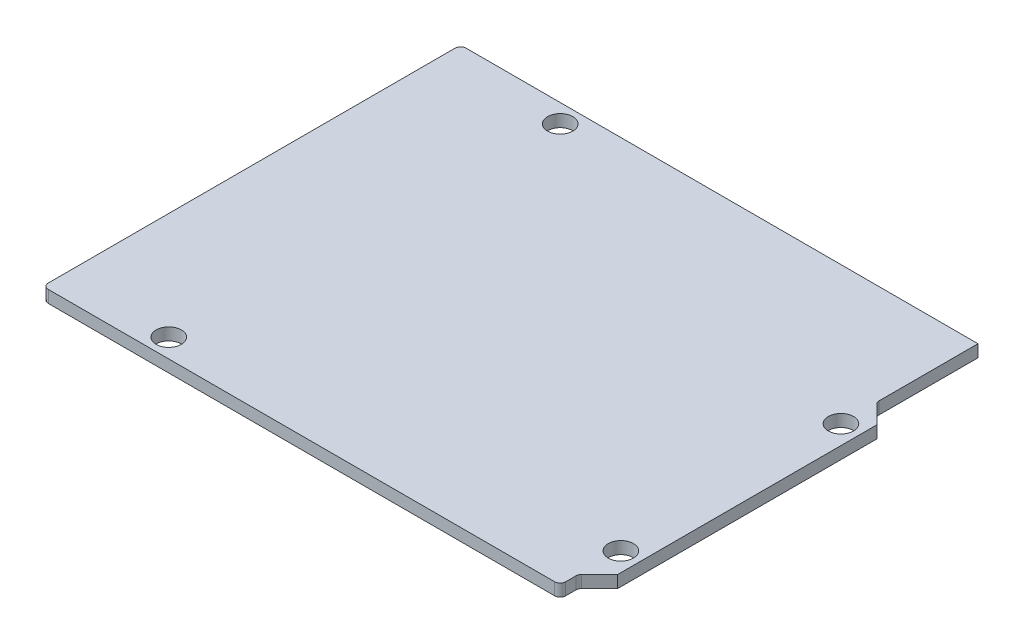
ISO-10303-21;
HEADER;
FILE_DESCRIPTION(('STEP AP214'),'2;1');
FILE_NAME('part.step','',(''),(''),'','','');
FILE_SCHEMA(('AUTOMOTIVE_DESIGN { 1 0 10303 214 1 1 1 1 }'));
ENDSEC;
DATA;
#1=APPLICATION_CONTEXT('core data for automotive mechanical design processes');
#2=APPLICATION_PROTOCOL_DEFINITION('international standard','automotive_design',2000,#1);
#3=PRODUCT_CONTEXT('',#1,'mechanical');
#4=PRODUCT('Part','Part','',(#3));
#5=PRODUCT_RELATED_PRODUCT_CATEGORY('part','',(#4));
#6=PRODUCT_DEFINITION_FORMATION('','',#4);
#7=PRODUCT_DEFINITION_CONTEXT('part definition',#1,'design');
#8=PRODUCT_DEFINITION('design','',#6,#7);
#9=PRODUCT_DEFINITION_SHAPE('','',#8);
#10=(LENGTH_UNIT() NAMED_UNIT(*) SI_UNIT(.MILLI.,.METRE.));
#11=(NAMED_UNIT(*) PLANE_ANGLE_UNIT() SI_UNIT($,.RADIAN.));
#12=(NAMED_UNIT(*) SI_UNIT($,.STERADIAN.) SOLID_ANGLE_UNIT());
#13=UNCERTAINTY_MEASURE_WITH_UNIT(LENGTH_MEASURE(1.E-05),#10,'distance_accuracy_value','');
#14=(GEOMETRIC_REPRESENTATION_CONTEXT(3) GLOBAL_UNCERTAINTY_ASSIGNED_CONTEXT((#13)) GLOBAL_UNIT_ASSIGNED_CONTEXT((#10,
#11,#12)) REPRESENTATION_CONTEXT('',''));
#15=CARTESIAN_POINT('',(0.,0.,0.));
#16=DIRECTION('',(0.,0.,1.));
#17=DIRECTION('',(1.,0.,0.));
#18=AXIS2_PLACEMENT_3D('',#15,#16,#17);
#19=CARTESIAN_POINT('',(0.,1.55,0.));
#20=DIRECTION('',(0.,-1.,0.));
#21=DIRECTION('',(0.,0.,-1.));
#22=AXIS2_PLACEMENT_3D('',#19,#20,#21);
#23=PLANE('',#22);
#24=CARTESIAN_POINT('',(65.8,1.55,-7.6));
#25=DIRECTION('',(0.,1.,0.));
#26=DIRECTION('',(0.,0.,1.));
#27=AXIS2_PLACEMENT_3D('',#24,#25,#26);
#28=CIRCLE('',#27,1.60000000000001);
#29=CARTESIAN_POINT('',(65.8,1.55,-5.99999999999999));
#30=VERTEX_POINT('',#29);
#31=EDGE_CURVE('E370',#30,#30,#28,.T.);
#32=ORIENTED_EDGE('',*,*,#31,.F.);
#33=EDGE_LOOP('',(#32));
#34=FACE_BOUND('',#33,.T.);
#35=CARTESIAN_POINT('',(15.,1.55,-50.7));
#36=DIRECTION('',(0.,1.,0.));
#37=DIRECTION('',(0.,0.,1.));
#38=AXIS2_PLACEMENT_3D('',#35,#36,#37);
#39=CIRCLE('',#38,1.6);
#40=CARTESIAN_POINT('',(15.,1.55,-49.1));
#41=VERTEX_POINT('',#40);
#42=EDGE_CURVE('E186',#41,#41,#39,.T.);
#43=ORIENTED_EDGE('',*,*,#42,.F.);
#44=EDGE_LOOP('',(#43));
#45=FACE_BOUND('',#44,.T.);
#46=DIRECTION('',(1.,0.,0.));
#47=VECTOR('',#46,1.);
#48=CARTESIAN_POINT('',(0.,1.55,0.));
#49=LINE('',#48,#47);
#50=CARTESIAN_POINT('',(0.7,1.55,0.));
#51=VERTEX_POINT('',#50);
#52=CARTESIAN_POINT('',(65.,1.55,0.));
#53=VERTEX_POINT('',#52);
#54=EDGE_CURVE('E336',#51,#53,#49,.T.);
#55=ORIENTED_EDGE('',*,*,#54,.T.);
#56=CARTESIAN_POINT('',(65.,1.55,-0.7));
#57=DIRECTION('',(0.,-1.,0.));
#58=DIRECTION('',(0.,0.,-1.));
#59=AXIS2_PLACEMENT_3D('',#56,#57,#58);
#60=CIRCLE('',#59,0.7);
#61=CARTESIAN_POINT('',(65.7,1.55,-0.7));
#62=VERTEX_POINT('',#61);
#63=EDGE_CURVE('E252',#53,#62,#60,.F.);
#64=ORIENTED_EDGE('',*,*,#63,.T.);
#65=DIRECTION('',(0.,0.,-1.));
#66=VECTOR('',#65,1.);
#67=CARTESIAN_POINT('',(65.7,1.55,-2.3));
#68=LINE('',#67,#66);
#69=CARTESIAN_POINT('',(65.7,1.55,-2.01005050633884));
#70=VERTEX_POINT('',#69);
#71=EDGE_CURVE('E150',#62,#70,#68,.T.);
#72=ORIENTED_EDGE('',*,*,#71,.T.);
#73=CARTESIAN_POINT('',(66.4,1.55,-2.01005050633884));
#74=DIRECTION('',(0.,-1.,0.));
#75=DIRECTION('',(0.,0.,-1.));
#76=AXIS2_PLACEMENT_3D('',#73,#74,#75);
#77=CIRCLE('',#76,0.7);
#78=CARTESIAN_POINT('',(65.9050252531694,1.55,-2.50502525316943));
#79=VERTEX_POINT('',#78);
#80=EDGE_CURVE('E11',#70,#79,#77,.T.);
#81=ORIENTED_EDGE('',*,*,#80,.T.);
#82=DIRECTION('',(0.707106781186549,0.,-0.707106781186546));
#83=VECTOR('',#82,1.);
#84=CARTESIAN_POINT('',(68.2,1.55,-4.79999999999999));
#85=LINE('',#84,#83);
#86=CARTESIAN_POINT('',(68.2,1.55,-4.79999999999999));
#87=VERTEX_POINT('',#86);
#88=EDGE_CURVE('E136',#79,#87,#85,.T.);
#89=ORIENTED_EDGE('',*,*,#88,.T.);
#90=DIRECTION('',(0.,0.,-1.));
#91=VECTOR('',#90,1.);
#92=CARTESIAN_POINT('',(68.2,1.55,-4.79999999999999));
#93=LINE('',#92,#91);
#94=CARTESIAN_POINT('',(68.2,1.55,-37.7));
#95=VERTEX_POINT('',#94);
#96=EDGE_CURVE('E142',#87,#95,#93,.T.);
#97=ORIENTED_EDGE('',*,*,#96,.T.);
#98=DIRECTION('',(-0.707106781186548,0.,-0.707106781186546));
#99=VECTOR('',#98,1.);
#100=CARTESIAN_POINT('',(65.7,1.55,-40.2));
#101=LINE('',#100,#99);
#102=CARTESIAN_POINT('',(65.9050252531694,1.55,-39.9949747468306));
#103=VERTEX_POINT('',#102);
#104=EDGE_CURVE('E167',#95,#103,#101,.T.);
#105=ORIENTED_EDGE('',*,*,#104,.T.);
#106=CARTESIAN_POINT('',(66.4,1.55,-40.4899494936611));
#107=DIRECTION('',(0.,-1.,0.));
#108=DIRECTION('',(0.,0.,-1.));
#109=AXIS2_PLACEMENT_3D('',#106,#107,#108);
#110=CIRCLE('',#109,0.7);
#111=CARTESIAN_POINT('',(65.7,1.55,-40.4899494936612));
#112=VERTEX_POINT('',#111);
#113=EDGE_CURVE('E265',#103,#112,#110,.T.);
#114=ORIENTED_EDGE('',*,*,#113,.T.);
#115=DIRECTION('',(0.,0.,-1.));
#116=VECTOR('',#115,1.);
#117=CARTESIAN_POINT('',(65.7,1.55,-53.05));
#118=LINE('',#117,#116);
#119=CARTESIAN_POINT('',(65.7,1.55,-53.05));
#120=VERTEX_POINT('',#119);
#121=EDGE_CURVE('E172',#112,#120,#118,.T.);
#122=ORIENTED_EDGE('',*,*,#121,.T.);
#123=DIRECTION('',(-1.,0.,0.));
#124=VECTOR('',#123,1.);
#125=CARTESIAN_POINT('',(0.,1.55,-53.05));
#126=LINE('',#125,#124);
#127=CARTESIAN_POINT('',(0.7,1.55,-53.05));
#128=VERTEX_POINT('',#127);
#129=EDGE_CURVE('E178',#120,#128,#126,.T.);
#130=ORIENTED_EDGE('',*,*,#129,.T.);
#131=CARTESIAN_POINT('',(0.7,1.55,-52.35));
#132=DIRECTION('',(0.,-1.,0.));
#133=DIRECTION('',(0.,0.,-1.));
#134=AXIS2_PLACEMENT_3D('',#131,#132,#133);
#135=CIRCLE('',#134,0.7);
#136=CARTESIAN_POINT('',(0.,1.55,-52.35));
#137=VERTEX_POINT('',#136);
#138=EDGE_CURVE('E249',#128,#137,#135,.F.);
#139=ORIENTED_EDGE('',*,*,#138,.T.);
#140=DIRECTION('',(0.,0.,1.));
#141=VECTOR('',#140,1.);
#142=CARTESIAN_POINT('',(0.,1.55,0.));
#143=LINE('',#142,#141);
#144=CARTESIAN_POINT('',(0.,1.55,-0.7));
#145=VERTEX_POINT('',#144);
#146=EDGE_CURVE('E208',#137,#145,#143,.T.);
#147=ORIENTED_EDGE('',*,*,#146,.T.);
#148=CARTESIAN_POINT('',(0.7,1.55,-0.7));
#149=DIRECTION('',(0.,-1.,0.));
#150=DIRECTION('',(0.,0.,-1.));
#151=AXIS2_PLACEMENT_3D('',#148,#149,#150);
#152=CIRCLE('',#151,0.7);
#153=EDGE_CURVE('E246',#145,#51,#152,.F.);
#154=ORIENTED_EDGE('',*,*,#153,.T.);
#155=EDGE_LOOP('',(#55,#64,#72,#81,#89,#97,#105,#114,#122,#130,#139,#147,#154));
#156=FACE_BOUND('',#155,.T.);
#157=CARTESIAN_POINT('',(13.6,1.55,-2.4));
#158=DIRECTION('',(0.,1.,0.));
#159=DIRECTION('',(0.,0.,1.));
#160=AXIS2_PLACEMENT_3D('',#157,#158,#159);
#161=CIRCLE('',#160,1.6);
#162=CARTESIAN_POINT('',(13.6,1.55,-0.799999999999998));
#163=VERTEX_POINT('',#162);
#164=EDGE_CURVE('E362',#163,#163,#161,.T.);
#165=ORIENTED_EDGE('',*,*,#164,.F.);
#166=EDGE_LOOP('',(#165));
#167=FACE_BOUND('',#166,.T.);
#168=CARTESIAN_POINT('',(65.8,1.55,-35.55));
#169=DIRECTION('',(0.,1.,0.));
#170=DIRECTION('',(0.,0.,1.));
#171=AXIS2_PLACEMENT_3D('',#168,#169,#170);
#172=CIRCLE('',#171,1.60000000000001);
#173=CARTESIAN_POINT('',(65.8,1.55,-33.95));
#174=VERTEX_POINT('',#173);
#175=EDGE_CURVE('E378',#174,#174,#172,.T.);
#176=ORIENTED_EDGE('',*,*,#175,.F.);
#177=EDGE_LOOP('',(#176));
#178=FACE_BOUND('',#177,.T.);
#179=ADVANCED_FACE('F38',(#34,#45,#156,#167,#178),#23,.F.);
#180=CARTESIAN_POINT('',(0.,0.,0.));
#181=DIRECTION('',(0.,-1.,0.));
#182=DIRECTION('',(0.,0.,-1.));
#183=AXIS2_PLACEMENT_3D('',#180,#181,#182);
#184=PLANE('',#183);
#185=CARTESIAN_POINT('',(65.8,0.,-7.6));
#186=DIRECTION('',(0.,1.,0.));
#187=DIRECTION('',(0.,0.,1.));
#188=AXIS2_PLACEMENT_3D('',#185,#186,#187);
#189=CIRCLE('',#188,1.60000000000001);
#190=CARTESIAN_POINT('',(65.8,0.,-5.99999999999999));
#191=VERTEX_POINT('',#190);
#192=EDGE_CURVE('E374',#191,#191,#189,.T.);
#193=ORIENTED_EDGE('',*,*,#192,.T.);
#194=EDGE_LOOP('',(#193));
#195=FACE_BOUND('',#194,.T.);
#196=CARTESIAN_POINT('',(15.,0.,-50.7));
#197=DIRECTION('',(0.,1.,0.));
#198=DIRECTION('',(0.,0.,1.));
#199=AXIS2_PLACEMENT_3D('',#196,#197,#198);
#200=CIRCLE('',#199,1.6);
#201=CARTESIAN_POINT('',(15.,0.,-49.1));
#202=VERTEX_POINT('',#201);
#203=EDGE_CURVE('E358',#202,#202,#200,.T.);
#204=ORIENTED_EDGE('',*,*,#203,.T.);
#205=EDGE_LOOP('',(#204));
#206=FACE_BOUND('',#205,.T.);
#207=DIRECTION('',(0.,0.,-1.));
#208=VECTOR('',#207,1.);
#209=CARTESIAN_POINT('',(65.7,0.,-2.3));
#210=LINE('',#209,#208);
#211=CARTESIAN_POINT('',(65.7,0.,-0.7));
#212=VERTEX_POINT('',#211);
#213=CARTESIAN_POINT('',(65.7,0.,-2.01005050633884));
#214=VERTEX_POINT('',#213);
#215=EDGE_CURVE('E190',#212,#214,#210,.T.);
#216=ORIENTED_EDGE('',*,*,#215,.F.);
#217=CARTESIAN_POINT('',(65.,0.,-0.7));
#218=DIRECTION('',(0.,-1.,0.));
#219=DIRECTION('',(0.,0.,-1.));
#220=AXIS2_PLACEMENT_3D('',#217,#218,#219);
#221=CIRCLE('',#220,0.7);
#222=CARTESIAN_POINT('',(65.,0.,0.));
#223=VERTEX_POINT('',#222);
#224=EDGE_CURVE('E236',#212,#223,#221,.T.);
#225=ORIENTED_EDGE('',*,*,#224,.T.);
#226=DIRECTION('',(1.,0.,0.));
#227=VECTOR('',#226,1.);
#228=CARTESIAN_POINT('',(0.,0.,0.));
#229=LINE('',#228,#227);
#230=CARTESIAN_POINT('',(0.7,0.,0.));
#231=VERTEX_POINT('',#230);
#232=EDGE_CURVE('E185',#231,#223,#229,.T.);
#233=ORIENTED_EDGE('',*,*,#232,.F.);
#234=CARTESIAN_POINT('',(0.7,0.,-0.7));
#235=DIRECTION('',(0.,-1.,0.));
#236=DIRECTION('',(0.,0.,-1.));
#237=AXIS2_PLACEMENT_3D('',#234,#235,#236);
#238=CIRCLE('',#237,0.7);
#239=CARTESIAN_POINT('',(0.,0.,-0.7));
#240=VERTEX_POINT('',#239);
#241=EDGE_CURVE('E230',#231,#240,#238,.T.);
#242=ORIENTED_EDGE('',*,*,#241,.T.);
#243=DIRECTION('',(0.,0.,1.));
#244=VECTOR('',#243,1.);
#245=CARTESIAN_POINT('',(0.,0.,0.));
#246=LINE('',#245,#244);
#247=CARTESIAN_POINT('',(0.,0.,-52.35));
#248=VERTEX_POINT('',#247);
#249=EDGE_CURVE('E182',#248,#240,#246,.T.);
#250=ORIENTED_EDGE('',*,*,#249,.F.);
#251=CARTESIAN_POINT('',(0.7,0.,-52.35));
#252=DIRECTION('',(0.,-1.,0.));
#253=DIRECTION('',(0.,0.,-1.));
#254=AXIS2_PLACEMENT_3D('',#251,#252,#253);
#255=CIRCLE('',#254,0.7);
#256=CARTESIAN_POINT('',(0.7,0.,-53.05));
#257=VERTEX_POINT('',#256);
#258=EDGE_CURVE('E233',#248,#257,#255,.T.);
#259=ORIENTED_EDGE('',*,*,#258,.T.);
#260=DIRECTION('',(-1.,0.,0.));
#261=VECTOR('',#260,1.);
#262=CARTESIAN_POINT('',(0.,0.,-53.05));
#263=LINE('',#262,#261);
#264=CARTESIAN_POINT('',(65.7,0.,-53.05));
#265=VERTEX_POINT('',#264);
#266=EDGE_CURVE('E205',#265,#257,#263,.T.);
#267=ORIENTED_EDGE('',*,*,#266,.F.);
#268=DIRECTION('',(0.,0.,-1.));
#269=VECTOR('',#268,1.);
#270=CARTESIAN_POINT('',(65.7,0.,-53.05));
#271=LINE('',#270,#269);
#272=CARTESIAN_POINT('',(65.7,0.,-40.4899494936612));
#273=VERTEX_POINT('',#272);
#274=EDGE_CURVE('E202',#273,#265,#271,.T.);
#275=ORIENTED_EDGE('',*,*,#274,.F.);
#276=CARTESIAN_POINT('',(66.4,0.,-40.4899494936611));
#277=DIRECTION('',(0.,-1.,0.));
#278=DIRECTION('',(0.,0.,-1.));
#279=AXIS2_PLACEMENT_3D('',#276,#277,#278);
#280=CIRCLE('',#279,0.7);
#281=CARTESIAN_POINT('',(65.9050252531694,0.,-39.9949747468306));
#282=VERTEX_POINT('',#281);
#283=EDGE_CURVE('E263',#273,#282,#280,.F.);
#284=ORIENTED_EDGE('',*,*,#283,.T.);
#285=DIRECTION('',(-0.707106781186548,0.,-0.707106781186546));
#286=VECTOR('',#285,1.);
#287=CARTESIAN_POINT('',(65.7,0.,-40.2));
#288=LINE('',#287,#286);
#289=CARTESIAN_POINT('',(68.2,0.,-37.7));
#290=VERTEX_POINT('',#289);
#291=EDGE_CURVE('E198',#290,#282,#288,.T.);
#292=ORIENTED_EDGE('',*,*,#291,.F.);
#293=DIRECTION('',(0.,0.,-1.));
#294=VECTOR('',#293,1.);
#295=CARTESIAN_POINT('',(68.2,0.,-4.79999999999999));
#296=LINE('',#295,#294);
#297=CARTESIAN_POINT('',(68.2,0.,-4.79999999999999));
#298=VERTEX_POINT('',#297);
#299=EDGE_CURVE('E196',#298,#290,#296,.T.);
#300=ORIENTED_EDGE('',*,*,#299,.F.);
#301=DIRECTION('',(0.707106781186549,0.,-0.707106781186546));
#302=VECTOR('',#301,1.);
#303=CARTESIAN_POINT('',(68.2,0.,-4.79999999999999));
#304=LINE('',#303,#302);
#305=CARTESIAN_POINT('',(65.9050252531694,0.,-2.50502525316943));
#306=VERTEX_POINT('',#305);
#307=EDGE_CURVE('E156',#306,#298,#304,.T.);
#308=ORIENTED_EDGE('',*,*,#307,.F.);
#309=CARTESIAN_POINT('',(66.4,0.,-2.01005050633884));
#310=DIRECTION('',(0.,-1.,0.));
#311=DIRECTION('',(0.,0.,-1.));
#312=AXIS2_PLACEMENT_3D('',#309,#310,#311);
#313=CIRCLE('',#312,0.7);
#314=EDGE_CURVE('E47',#306,#214,#313,.F.);
#315=ORIENTED_EDGE('',*,*,#314,.T.);
#316=EDGE_LOOP('',(#216,#225,#233,#242,#250,#259,#267,#275,#284,#292,#300,#308,#315));
#317=FACE_BOUND('',#316,.T.);
#318=CARTESIAN_POINT('',(13.6,0.,-2.4));
#319=DIRECTION('',(0.,1.,0.));
#320=DIRECTION('',(0.,0.,1.));
#321=AXIS2_PLACEMENT_3D('',#318,#319,#320);
#322=CIRCLE('',#321,1.6);
#323=CARTESIAN_POINT('',(13.6,0.,-0.799999999999998));
#324=VERTEX_POINT('',#323);
#325=EDGE_CURVE('E366',#324,#324,#322,.T.);
#326=ORIENTED_EDGE('',*,*,#325,.T.);
#327=EDGE_LOOP('',(#326));
#328=FACE_BOUND('',#327,.T.);
#329=CARTESIAN_POINT('',(65.8,0.,-35.55));
#330=DIRECTION('',(0.,1.,0.));
#331=DIRECTION('',(0.,0.,1.));
#332=AXIS2_PLACEMENT_3D('',#329,#330,#331);
#333=CIRCLE('',#332,1.60000000000001);
#334=CARTESIAN_POINT('',(65.8,0.,-33.95));
#335=VERTEX_POINT('',#334);
#336=EDGE_CURVE('E382',#335,#335,#333,.T.);
#337=ORIENTED_EDGE('',*,*,#336,.T.);
#338=EDGE_LOOP('',(#337));
#339=FACE_BOUND('',#338,.T.);
#340=ADVANCED_FACE('F270',(#195,#206,#317,#328,#339),#184,.T.);
#341=CARTESIAN_POINT('',(0.,1.55,0.));
#342=DIRECTION('',(1.,0.,0.));
#343=DIRECTION('',(0.,0.,-1.));
#344=AXIS2_PLACEMENT_3D('',#341,#342,#343);
#345=PLANE('',#344);
#346=ORIENTED_EDGE('',*,*,#146,.F.);
#347=DIRECTION('',(0.,-1.,0.));
#348=VECTOR('',#347,1.);
#349=CARTESIAN_POINT('',(0.,1.55,-52.35));
#350=LINE('',#349,#348);
#351=EDGE_CURVE('E257',#137,#248,#350,.T.);
#352=ORIENTED_EDGE('',*,*,#351,.T.);
#353=ORIENTED_EDGE('',*,*,#249,.T.);
#354=DIRECTION('',(0.,-1.,0.));
#355=VECTOR('',#354,1.);
#356=CARTESIAN_POINT('',(0.,1.55,-0.7));
#357=LINE('',#356,#355);
#358=EDGE_CURVE('E62',#240,#145,#357,.F.);
#359=ORIENTED_EDGE('',*,*,#358,.T.);
#360=EDGE_LOOP('',(#346,#352,#353,#359));
#361=FACE_BOUND('',#360,.T.);
#362=ADVANCED_FACE('F299',(#361),#345,.F.);
#363=CARTESIAN_POINT('',(0.,1.55,0.));
#364=DIRECTION('',(0.,0.,-1.));
#365=DIRECTION('',(-1.,0.,0.));
#366=AXIS2_PLACEMENT_3D('',#363,#364,#365);
#367=PLANE('',#366);
#368=ORIENTED_EDGE('',*,*,#232,.T.);
#369=DIRECTION('',(0.,-1.,0.));
#370=VECTOR('',#369,1.);
#371=CARTESIAN_POINT('',(65.,1.55,0.));
#372=LINE('',#371,#370);
#373=EDGE_CURVE('E243',#223,#53,#372,.F.);
#374=ORIENTED_EDGE('',*,*,#373,.T.);
#375=ORIENTED_EDGE('',*,*,#54,.F.);
#376=DIRECTION('',(0.,-1.,0.));
#377=VECTOR('',#376,1.);
#378=CARTESIAN_POINT('',(0.7,1.55,0.));
#379=LINE('',#378,#377);
#380=EDGE_CURVE('E239',#51,#231,#379,.T.);
#381=ORIENTED_EDGE('',*,*,#380,.T.);
#382=EDGE_LOOP('',(#368,#374,#375,#381));
#383=FACE_BOUND('',#382,.T.);
#384=ADVANCED_FACE('F325',(#383),#367,.F.);
#385=CARTESIAN_POINT('',(65.7,1.55,-2.3));
#386=DIRECTION('',(-1.,0.,0.));
#387=DIRECTION('',(0.,0.,1.));
#388=AXIS2_PLACEMENT_3D('',#385,#386,#387);
#389=PLANE('',#388);
#390=ORIENTED_EDGE('',*,*,#215,.T.);
#391=DIRECTION('',(0.,-1.,0.));
#392=VECTOR('',#391,1.);
#393=CARTESIAN_POINT('',(65.7,1.55,-2.01005050633884));
#394=LINE('',#393,#392);
#395=EDGE_CURVE('E227',#214,#70,#394,.F.);
#396=ORIENTED_EDGE('',*,*,#395,.T.);
#397=ORIENTED_EDGE('',*,*,#71,.F.);
#398=DIRECTION('',(0.,-1.,0.));
#399=VECTOR('',#398,1.);
#400=CARTESIAN_POINT('',(65.7,1.55,-0.7));
#401=LINE('',#400,#399);
#402=EDGE_CURVE('E223',#62,#212,#401,.T.);
#403=ORIENTED_EDGE('',*,*,#402,.T.);
#404=EDGE_LOOP('',(#390,#396,#397,#403));
#405=FACE_BOUND('',#404,.T.);
#406=ADVANCED_FACE('F275',(#405),#389,.F.);
#407=CARTESIAN_POINT('',(68.2,1.55,-4.79999999999999));
#408=DIRECTION('',(-0.707106781186546,0.,-0.707106781186549));
#409=DIRECTION('',(-0.707106781186549,0.,0.707106781186546));
#410=AXIS2_PLACEMENT_3D('',#407,#408,#409);
#411=PLANE('',#410);
#412=ORIENTED_EDGE('',*,*,#88,.F.);
#413=DIRECTION('',(0.,-1.,0.));
#414=VECTOR('',#413,1.);
#415=CARTESIAN_POINT('',(65.9050252531694,0.,-2.50502525316943));
#416=LINE('',#415,#414);
#417=EDGE_CURVE('E220',#79,#306,#416,.T.);
#418=ORIENTED_EDGE('',*,*,#417,.T.);
#419=ORIENTED_EDGE('',*,*,#307,.T.);
#420=DIRECTION('',(0.,-1.,0.));
#421=VECTOR('',#420,1.);
#422=CARTESIAN_POINT('',(68.2,1.55,-4.79999999999999));
#423=LINE('',#422,#421);
#424=EDGE_CURVE('E153',#87,#298,#423,.T.);
#425=ORIENTED_EDGE('',*,*,#424,.F.);
#426=EDGE_LOOP('',(#412,#418,#419,#425));
#427=FACE_BOUND('',#426,.T.);
#428=ADVANCED_FACE('F154',(#427),#411,.F.);
#429=CARTESIAN_POINT('',(68.2,1.55,-4.79999999999999));
#430=DIRECTION('',(-1.,0.,0.));
#431=DIRECTION('',(0.,0.,1.));
#432=AXIS2_PLACEMENT_3D('',#429,#430,#431);
#433=PLANE('',#432);
#434=ORIENTED_EDGE('',*,*,#299,.T.);
#435=DIRECTION('',(0.,-1.,0.));
#436=VECTOR('',#435,1.);
#437=CARTESIAN_POINT('',(68.2,1.55,-37.7));
#438=LINE('',#437,#436);
#439=EDGE_CURVE('E161',#95,#290,#438,.T.);
#440=ORIENTED_EDGE('',*,*,#439,.F.);
#441=ORIENTED_EDGE('',*,*,#96,.F.);
#442=ORIENTED_EDGE('',*,*,#424,.T.);
#443=EDGE_LOOP('',(#434,#440,#441,#442));
#444=FACE_BOUND('',#443,.T.);
#445=ADVANCED_FACE('F163',(#444),#433,.F.);
#446=CARTESIAN_POINT('',(65.7,1.55,-40.2));
#447=DIRECTION('',(-0.707106781186546,0.,0.707106781186549));
#448=DIRECTION('',(0.707106781186549,0.,0.707106781186546));
#449=AXIS2_PLACEMENT_3D('',#446,#447,#448);
#450=PLANE('',#449);
#451=ORIENTED_EDGE('',*,*,#291,.T.);
#452=DIRECTION('',(0.,-1.,0.));
#453=VECTOR('',#452,1.);
#454=CARTESIAN_POINT('',(65.9050252531694,1.55,-39.9949747468306));
#455=LINE('',#454,#453);
#456=EDGE_CURVE('E217',#282,#103,#455,.F.);
#457=ORIENTED_EDGE('',*,*,#456,.T.);
#458=ORIENTED_EDGE('',*,*,#104,.F.);
#459=ORIENTED_EDGE('',*,*,#439,.T.);
#460=EDGE_LOOP('',(#451,#457,#458,#459));
#461=FACE_BOUND('',#460,.T.);
#462=ADVANCED_FACE('F314',(#461),#450,.F.);
#463=CARTESIAN_POINT('',(65.7,1.55,-53.05));
#464=DIRECTION('',(-1.,0.,0.));
#465=DIRECTION('',(0.,0.,1.));
#466=AXIS2_PLACEMENT_3D('',#463,#464,#465);
#467=PLANE('',#466);
#468=ORIENTED_EDGE('',*,*,#121,.F.);
#469=DIRECTION('',(0.,-1.,0.));
#470=VECTOR('',#469,1.);
#471=CARTESIAN_POINT('',(65.7,0.,-40.4899494936611));
#472=LINE('',#471,#470);
#473=EDGE_CURVE('E160',#112,#273,#472,.T.);
#474=ORIENTED_EDGE('',*,*,#473,.T.);
#475=ORIENTED_EDGE('',*,*,#274,.T.);
#476=DIRECTION('',(0.,-1.,0.));
#477=VECTOR('',#476,1.);
#478=CARTESIAN_POINT('',(65.7,1.55,-53.05));
#479=LINE('',#478,#477);
#480=EDGE_CURVE('E181',#120,#265,#479,.T.);
#481=ORIENTED_EDGE('',*,*,#480,.F.);
#482=EDGE_LOOP('',(#468,#474,#475,#481));
#483=FACE_BOUND('',#482,.T.);
#484=ADVANCED_FACE('F311',(#483),#467,.F.);
#485=CARTESIAN_POINT('',(0.,1.55,-53.05));
#486=DIRECTION('',(0.,0.,1.));
#487=DIRECTION('',(1.,0.,0.));
#488=AXIS2_PLACEMENT_3D('',#485,#486,#487);
#489=PLANE('',#488);
#490=ORIENTED_EDGE('',*,*,#266,.T.);
#491=DIRECTION('',(0.,-1.,0.));
#492=VECTOR('',#491,1.);
#493=CARTESIAN_POINT('',(0.7,1.55,-53.05));
#494=LINE('',#493,#492);
#495=EDGE_CURVE('E54',#257,#128,#494,.F.);
#496=ORIENTED_EDGE('',*,*,#495,.T.);
#497=ORIENTED_EDGE('',*,*,#129,.F.);
#498=ORIENTED_EDGE('',*,*,#480,.T.);
#499=EDGE_LOOP('',(#490,#496,#497,#498));
#500=FACE_BOUND('',#499,.T.);
#501=ADVANCED_FACE('F308',(#500),#489,.F.);
#502=CARTESIAN_POINT('',(15.,1.55,-50.7));
#503=DIRECTION('',(0.,-1.,0.));
#504=DIRECTION('',(0.,0.,-1.));
#505=AXIS2_PLACEMENT_3D('',#502,#503,#504);
#506=CYLINDRICAL_SURFACE('',#505,1.6);
#507=ORIENTED_EDGE('',*,*,#42,.T.);
#508=EDGE_LOOP('',(#507));
#509=FACE_BOUND('',#508,.T.);
#510=ORIENTED_EDGE('',*,*,#203,.F.);
#511=EDGE_LOOP('',(#510));
#512=FACE_BOUND('',#511,.T.);
#513=ADVANCED_FACE('F305',(#509,#512),#506,.F.);
#514=CARTESIAN_POINT('',(13.6,1.55,-2.4));
#515=DIRECTION('',(0.,-1.,0.));
#516=DIRECTION('',(0.,0.,-1.));
#517=AXIS2_PLACEMENT_3D('',#514,#515,#516);
#518=CYLINDRICAL_SURFACE('',#517,1.6);
#519=ORIENTED_EDGE('',*,*,#164,.T.);
#520=EDGE_LOOP('',(#519));
#521=FACE_BOUND('',#520,.T.);
#522=ORIENTED_EDGE('',*,*,#325,.F.);
#523=EDGE_LOOP('',(#522));
#524=FACE_BOUND('',#523,.T.);
#525=ADVANCED_FACE('F400',(#521,#524),#518,.F.);
#526=CARTESIAN_POINT('',(65.8,1.55,-7.6));
#527=DIRECTION('',(0.,-1.,0.));
#528=DIRECTION('',(0.,0.,-1.));
#529=AXIS2_PLACEMENT_3D('',#526,#527,#528);
#530=CYLINDRICAL_SURFACE('',#529,1.60000000000001);
#531=ORIENTED_EDGE('',*,*,#31,.T.);
#532=EDGE_LOOP('',(#531));
#533=FACE_BOUND('',#532,.T.);
#534=ORIENTED_EDGE('',*,*,#192,.F.);
#535=EDGE_LOOP('',(#534));
#536=FACE_BOUND('',#535,.T.);
#537=ADVANCED_FACE('F393',(#533,#536),#530,.F.);
#538=CARTESIAN_POINT('',(65.8,1.55,-35.55));
#539=DIRECTION('',(0.,-1.,0.));
#540=DIRECTION('',(0.,0.,-1.));
#541=AXIS2_PLACEMENT_3D('',#538,#539,#540);
#542=CYLINDRICAL_SURFACE('',#541,1.60000000000001);
#543=ORIENTED_EDGE('',*,*,#175,.T.);
#544=EDGE_LOOP('',(#543));
#545=FACE_BOUND('',#544,.T.);
#546=ORIENTED_EDGE('',*,*,#336,.F.);
#547=EDGE_LOOP('',(#546));
#548=FACE_BOUND('',#547,.T.);
#549=ADVANCED_FACE('F290',(#545,#548),#542,.F.);
#550=CARTESIAN_POINT('',(66.4,1.55,-40.4899494936611));
#551=DIRECTION('',(0.,1.,0.));
#552=DIRECTION('',(0.,0.,1.));
#553=AXIS2_PLACEMENT_3D('',#550,#551,#552);
#554=CYLINDRICAL_SURFACE('',#553,0.7);
#555=ORIENTED_EDGE('',*,*,#113,.F.);
#556=ORIENTED_EDGE('',*,*,#456,.F.);
#557=ORIENTED_EDGE('',*,*,#283,.F.);
#558=ORIENTED_EDGE('',*,*,#473,.F.);
#559=EDGE_LOOP('',(#555,#556,#557,#558));
#560=FACE_BOUND('',#559,.T.);
#561=ADVANCED_FACE('F281',(#560),#554,.F.);
#562=CARTESIAN_POINT('',(66.4,1.55,-2.01005050633884));
#563=DIRECTION('',(0.,1.,0.));
#564=DIRECTION('',(0.,0.,1.));
#565=AXIS2_PLACEMENT_3D('',#562,#563,#564);
#566=CYLINDRICAL_SURFACE('',#565,0.7);
#567=ORIENTED_EDGE('',*,*,#80,.F.);
#568=ORIENTED_EDGE('',*,*,#395,.F.);
#569=ORIENTED_EDGE('',*,*,#314,.F.);
#570=ORIENTED_EDGE('',*,*,#417,.F.);
#571=EDGE_LOOP('',(#567,#568,#569,#570));
#572=FACE_BOUND('',#571,.T.);
#573=ADVANCED_FACE('F278',(#572),#566,.F.);
#574=CARTESIAN_POINT('',(65.,1.55,-0.7));
#575=DIRECTION('',(0.,-1.,0.));
#576=DIRECTION('',(0.,0.,-1.));
#577=AXIS2_PLACEMENT_3D('',#574,#575,#576);
#578=CYLINDRICAL_SURFACE('',#577,0.7);
#579=ORIENTED_EDGE('',*,*,#63,.F.);
#580=ORIENTED_EDGE('',*,*,#373,.F.);
#581=ORIENTED_EDGE('',*,*,#224,.F.);
#582=ORIENTED_EDGE('',*,*,#402,.F.);
#583=EDGE_LOOP('',(#579,#580,#581,#582));
#584=FACE_BOUND('',#583,.T.);
#585=ADVANCED_FACE('F280',(#584),#578,.T.);
#586=CARTESIAN_POINT('',(0.7,1.55,-52.35));
#587=DIRECTION('',(0.,-1.,0.));
#588=DIRECTION('',(0.,0.,-1.));
#589=AXIS2_PLACEMENT_3D('',#586,#587,#588);
#590=CYLINDRICAL_SURFACE('',#589,0.7);
#591=ORIENTED_EDGE('',*,*,#138,.F.);
#592=ORIENTED_EDGE('',*,*,#495,.F.);
#593=ORIENTED_EDGE('',*,*,#258,.F.);
#594=ORIENTED_EDGE('',*,*,#351,.F.);
#595=EDGE_LOOP('',(#591,#592,#593,#594));
#596=FACE_BOUND('',#595,.T.);
#597=ADVANCED_FACE('F287',(#596),#590,.T.);
#598=CARTESIAN_POINT('',(0.7,1.55,-0.7));
#599=DIRECTION('',(0.,-1.,0.));
#600=DIRECTION('',(0.,0.,-1.));
#601=AXIS2_PLACEMENT_3D('',#598,#599,#600);
#602=CYLINDRICAL_SURFACE('',#601,0.7);
#603=ORIENTED_EDGE('',*,*,#153,.F.);
#604=ORIENTED_EDGE('',*,*,#358,.F.);
#605=ORIENTED_EDGE('',*,*,#241,.F.);
#606=ORIENTED_EDGE('',*,*,#380,.F.);
#607=EDGE_LOOP('',(#603,#604,#605,#606));
#608=FACE_BOUND('',#607,.T.);
#609=ADVANCED_FACE('F40',(#608),#602,.T.);
#610=CLOSED_SHELL('',(#179,#340,#362,#384,#406,#428,#445,#462,#484,#501,#513,#525,#537,#549,
#561,#573,#585,#597,#609));
#611=MANIFOLD_SOLID_BREP('B2',#610);
#612=ADVANCED_BREP_SHAPE_REPRESENTATION('',(#18,#611),#14);
#613=SHAPE_DEFINITION_REPRESENTATION(#9,#612);
ENDSEC;
END-ISO-10303-21;
